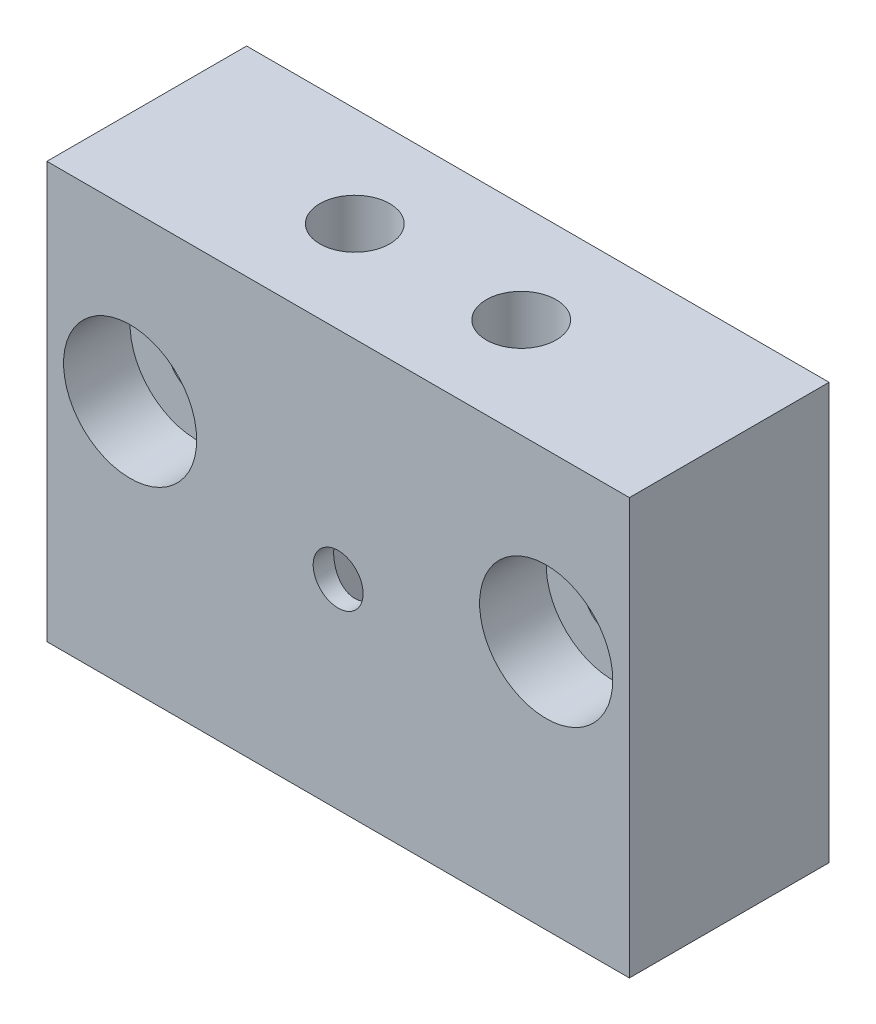
ISO-10303-21;
HEADER;
FILE_DESCRIPTION(('STEP AP214'),'2;1');
FILE_NAME('part.step','',(''),(''),'','','');
FILE_SCHEMA(('AUTOMOTIVE_DESIGN { 1 0 10303 214 1 1 1 1 }'));
ENDSEC;
DATA;
#1=APPLICATION_CONTEXT('core data for automotive mechanical design processes');
#2=APPLICATION_PROTOCOL_DEFINITION('international standard','automotive_design',2000,#1);
#3=PRODUCT_CONTEXT('',#1,'mechanical');
#4=PRODUCT('Part','Part','',(#3));
#5=PRODUCT_RELATED_PRODUCT_CATEGORY('part','',(#4));
#6=PRODUCT_DEFINITION_FORMATION('','',#4);
#7=PRODUCT_DEFINITION_CONTEXT('part definition',#1,'design');
#8=PRODUCT_DEFINITION('design','',#6,#7);
#9=PRODUCT_DEFINITION_SHAPE('','',#8);
#10=(LENGTH_UNIT() NAMED_UNIT(*) SI_UNIT(.MILLI.,.METRE.));
#11=(NAMED_UNIT(*) PLANE_ANGLE_UNIT() SI_UNIT($,.RADIAN.));
#12=(NAMED_UNIT(*) SI_UNIT($,.STERADIAN.) SOLID_ANGLE_UNIT());
#13=UNCERTAINTY_MEASURE_WITH_UNIT(LENGTH_MEASURE(1.E-05),#10,'distance_accuracy_value','');
#14=(GEOMETRIC_REPRESENTATION_CONTEXT(3) GLOBAL_UNCERTAINTY_ASSIGNED_CONTEXT((#13)) GLOBAL_UNIT_ASSIGNED_CONTEXT((#10,
#11,#12)) REPRESENTATION_CONTEXT('',''));
#15=CARTESIAN_POINT('',(0.,0.,0.));
#16=DIRECTION('',(0.,0.,1.));
#17=DIRECTION('',(1.,0.,0.));
#18=AXIS2_PLACEMENT_3D('',#15,#16,#17);
#19=CARTESIAN_POINT('',(12.5,15.,-6.));
#20=DIRECTION('',(0.,0.,1.));
#21=DIRECTION('',(1.,0.,0.));
#22=AXIS2_PLACEMENT_3D('',#19,#20,#21);
#23=CYLINDRICAL_SURFACE('',#22,1.75);
#24=CARTESIAN_POINT('',(12.5,15.,-6.));
#25=DIRECTION('',(0.,0.,1.));
#26=DIRECTION('',(1.,0.,0.));
#27=AXIS2_PLACEMENT_3D('',#24,#25,#26);
#28=CIRCLE('',#27,1.75);
#29=CARTESIAN_POINT('',(14.25,15.,-6.));
#30=VERTEX_POINT('',#29);
#31=EDGE_CURVE('E251',#30,#30,#28,.T.);
#32=ORIENTED_EDGE('',*,*,#31,.F.);
#33=EDGE_LOOP('',(#32));
#34=FACE_BOUND('',#33,.T.);
#35=CARTESIAN_POINT('',(12.5,15.,2.));
#36=DIRECTION('',(0.,0.,1.));
#37=DIRECTION('',(1.,0.,0.));
#38=AXIS2_PLACEMENT_3D('',#35,#36,#37);
#39=CIRCLE('',#38,1.75);
#40=CARTESIAN_POINT('',(14.25,15.,2.));
#41=VERTEX_POINT('',#40);
#42=EDGE_CURVE('E36',#41,#41,#39,.F.);
#43=ORIENTED_EDGE('',*,*,#42,.F.);
#44=EDGE_LOOP('',(#43));
#45=FACE_BOUND('',#44,.T.);
#46=ADVANCED_FACE('F32',(#34,#45),#23,.F.);
#47=CARTESIAN_POINT('',(-12.5,15.,-6.));
#48=DIRECTION('',(0.,0.,1.));
#49=DIRECTION('',(1.,0.,0.));
#50=AXIS2_PLACEMENT_3D('',#47,#48,#49);
#51=CYLINDRICAL_SURFACE('',#50,1.75);
#52=CARTESIAN_POINT('',(-12.5,15.,-6.));
#53=DIRECTION('',(0.,0.,1.));
#54=DIRECTION('',(1.,0.,0.));
#55=AXIS2_PLACEMENT_3D('',#52,#53,#54);
#56=CIRCLE('',#55,1.75);
#57=CARTESIAN_POINT('',(-10.75,15.,-6.));
#58=VERTEX_POINT('',#57);
#59=EDGE_CURVE('E254',#58,#58,#56,.T.);
#60=ORIENTED_EDGE('',*,*,#59,.F.);
#61=EDGE_LOOP('',(#60));
#62=FACE_BOUND('',#61,.T.);
#63=CARTESIAN_POINT('',(-12.5,15.,2.));
#64=DIRECTION('',(0.,0.,1.));
#65=DIRECTION('',(1.,0.,0.));
#66=AXIS2_PLACEMENT_3D('',#63,#64,#65);
#67=CIRCLE('',#66,1.75);
#68=CARTESIAN_POINT('',(-10.75,15.,2.));
#69=VERTEX_POINT('',#68);
#70=EDGE_CURVE('E176',#69,#69,#67,.F.);
#71=ORIENTED_EDGE('',*,*,#70,.F.);
#72=EDGE_LOOP('',(#71));
#73=FACE_BOUND('',#72,.T.);
#74=ADVANCED_FACE('F187',(#62,#73),#51,.F.);
#75=CARTESIAN_POINT('',(-17.5,25.,-6.));
#76=DIRECTION('',(1.,0.,0.));
#77=DIRECTION('',(0.,0.,-1.));
#78=AXIS2_PLACEMENT_3D('',#75,#76,#77);
#79=PLANE('',#78);
#80=DIRECTION('',(0.,0.,1.));
#81=VECTOR('',#80,1.);
#82=CARTESIAN_POINT('',(-17.5,0.,-6.));
#83=LINE('',#82,#81);
#84=CARTESIAN_POINT('',(-17.5,0.,-6.));
#85=VERTEX_POINT('',#84);
#86=CARTESIAN_POINT('',(-17.5,0.,6.));
#87=VERTEX_POINT('',#86);
#88=EDGE_CURVE('E132',#85,#87,#83,.T.);
#89=ORIENTED_EDGE('',*,*,#88,.T.);
#90=DIRECTION('',(0.,-1.,0.));
#91=VECTOR('',#90,1.);
#92=CARTESIAN_POINT('',(-17.5,25.,6.));
#93=LINE('',#92,#91);
#94=CARTESIAN_POINT('',(-17.5,25.,6.));
#95=VERTEX_POINT('',#94);
#96=EDGE_CURVE('E161',#95,#87,#93,.T.);
#97=ORIENTED_EDGE('',*,*,#96,.F.);
#98=DIRECTION('',(0.,0.,1.));
#99=VECTOR('',#98,1.);
#100=CARTESIAN_POINT('',(-17.5,25.,-6.));
#101=LINE('',#100,#99);
#102=CARTESIAN_POINT('',(-17.5,25.,-6.));
#103=VERTEX_POINT('',#102);
#104=EDGE_CURVE('E135',#103,#95,#101,.T.);
#105=ORIENTED_EDGE('',*,*,#104,.F.);
#106=DIRECTION('',(0.,-1.,0.));
#107=VECTOR('',#106,1.);
#108=CARTESIAN_POINT('',(-17.5,25.,-6.));
#109=LINE('',#108,#107);
#110=EDGE_CURVE('E145',#103,#85,#109,.T.);
#111=ORIENTED_EDGE('',*,*,#110,.T.);
#112=EDGE_LOOP('',(#89,#97,#105,#111));
#113=FACE_BOUND('',#112,.T.);
#114=ADVANCED_FACE('F34',(#113),#79,.F.);
#115=CARTESIAN_POINT('',(-17.5,25.,6.));
#116=DIRECTION('',(0.,0.,-1.));
#117=DIRECTION('',(-1.,0.,0.));
#118=AXIS2_PLACEMENT_3D('',#115,#116,#117);
#119=PLANE('',#118);
#120=CARTESIAN_POINT('',(12.5,15.,6.));
#121=DIRECTION('',(0.,0.,1.));
#122=DIRECTION('',(1.,0.,0.));
#123=AXIS2_PLACEMENT_3D('',#120,#121,#122);
#124=CIRCLE('',#123,4.);
#125=CARTESIAN_POINT('',(16.5,15.,6.));
#126=VERTEX_POINT('',#125);
#127=EDGE_CURVE('E244',#126,#126,#124,.T.);
#128=ORIENTED_EDGE('',*,*,#127,.F.);
#129=EDGE_LOOP('',(#128));
#130=FACE_BOUND('',#129,.T.);
#131=CARTESIAN_POINT('',(-12.5,15.,6.));
#132=DIRECTION('',(0.,0.,1.));
#133=DIRECTION('',(1.,0.,0.));
#134=AXIS2_PLACEMENT_3D('',#131,#132,#133);
#135=CIRCLE('',#134,4.);
#136=CARTESIAN_POINT('',(-8.5,15.,6.));
#137=VERTEX_POINT('',#136);
#138=EDGE_CURVE('E240',#137,#137,#135,.T.);
#139=ORIENTED_EDGE('',*,*,#138,.F.);
#140=EDGE_LOOP('',(#139));
#141=FACE_BOUND('',#140,.T.);
#142=CARTESIAN_POINT('',(0.,12.,6.));
#143=DIRECTION('',(0.,0.,1.));
#144=DIRECTION('',(1.,0.,0.));
#145=AXIS2_PLACEMENT_3D('',#142,#143,#144);
#146=CIRCLE('',#145,1.5);
#147=CARTESIAN_POINT('',(1.5,12.,6.));
#148=VERTEX_POINT('',#147);
#149=EDGE_CURVE('E175',#148,#148,#146,.T.);
#150=ORIENTED_EDGE('',*,*,#149,.F.);
#151=EDGE_LOOP('',(#150));
#152=FACE_BOUND('',#151,.T.);
#153=DIRECTION('',(1.,0.,0.));
#154=VECTOR('',#153,1.);
#155=CARTESIAN_POINT('',(-17.5,0.,6.));
#156=LINE('',#155,#154);
#157=CARTESIAN_POINT('',(17.5,0.,6.));
#158=VERTEX_POINT('',#157);
#159=EDGE_CURVE('E148',#87,#158,#156,.T.);
#160=ORIENTED_EDGE('',*,*,#159,.T.);
#161=DIRECTION('',(0.,-1.,0.));
#162=VECTOR('',#161,1.);
#163=CARTESIAN_POINT('',(17.5,25.,6.));
#164=LINE('',#163,#162);
#165=CARTESIAN_POINT('',(17.5,25.,6.));
#166=VERTEX_POINT('',#165);
#167=EDGE_CURVE('E158',#166,#158,#164,.T.);
#168=ORIENTED_EDGE('',*,*,#167,.F.);
#169=DIRECTION('',(1.,0.,0.));
#170=VECTOR('',#169,1.);
#171=CARTESIAN_POINT('',(-17.5,25.,6.));
#172=LINE('',#171,#170);
#173=EDGE_CURVE('E138',#95,#166,#172,.T.);
#174=ORIENTED_EDGE('',*,*,#173,.F.);
#175=ORIENTED_EDGE('',*,*,#96,.T.);
#176=EDGE_LOOP('',(#160,#168,#174,#175));
#177=FACE_BOUND('',#176,.T.);
#178=ADVANCED_FACE('F275',(#130,#141,#152,#177),#119,.F.);
#179=CARTESIAN_POINT('',(17.5,25.,-6.));
#180=DIRECTION('',(-1.,0.,0.));
#181=DIRECTION('',(0.,0.,1.));
#182=AXIS2_PLACEMENT_3D('',#179,#180,#181);
#183=PLANE('',#182);
#184=DIRECTION('',(0.,0.,-1.));
#185=VECTOR('',#184,1.);
#186=CARTESIAN_POINT('',(17.5,0.,-6.));
#187=LINE('',#186,#185);
#188=CARTESIAN_POINT('',(17.5,0.,-6.));
#189=VERTEX_POINT('',#188);
#190=EDGE_CURVE('E150',#158,#189,#187,.T.);
#191=ORIENTED_EDGE('',*,*,#190,.T.);
#192=DIRECTION('',(0.,-1.,0.));
#193=VECTOR('',#192,1.);
#194=CARTESIAN_POINT('',(17.5,25.,-6.));
#195=LINE('',#194,#193);
#196=CARTESIAN_POINT('',(17.5,25.,-6.));
#197=VERTEX_POINT('',#196);
#198=EDGE_CURVE('E155',#197,#189,#195,.T.);
#199=ORIENTED_EDGE('',*,*,#198,.F.);
#200=DIRECTION('',(0.,0.,-1.));
#201=VECTOR('',#200,1.);
#202=CARTESIAN_POINT('',(17.5,25.,-6.));
#203=LINE('',#202,#201);
#204=EDGE_CURVE('E141',#166,#197,#203,.T.);
#205=ORIENTED_EDGE('',*,*,#204,.F.);
#206=ORIENTED_EDGE('',*,*,#167,.T.);
#207=EDGE_LOOP('',(#191,#199,#205,#206));
#208=FACE_BOUND('',#207,.T.);
#209=ADVANCED_FACE('F280',(#208),#183,.F.);
#210=CARTESIAN_POINT('',(-17.5,25.,-6.));
#211=DIRECTION('',(0.,0.,1.));
#212=DIRECTION('',(1.,0.,0.));
#213=AXIS2_PLACEMENT_3D('',#210,#211,#212);
#214=PLANE('',#213);
#215=ORIENTED_EDGE('',*,*,#31,.T.);
#216=EDGE_LOOP('',(#215));
#217=FACE_BOUND('',#216,.T.);
#218=ORIENTED_EDGE('',*,*,#59,.T.);
#219=EDGE_LOOP('',(#218));
#220=FACE_BOUND('',#219,.T.);
#221=DIRECTION('',(-1.,0.,0.));
#222=VECTOR('',#221,1.);
#223=CARTESIAN_POINT('',(-17.5,0.,-6.));
#224=LINE('',#223,#222);
#225=EDGE_CURVE('E139',#189,#85,#224,.T.);
#226=ORIENTED_EDGE('',*,*,#225,.T.);
#227=ORIENTED_EDGE('',*,*,#110,.F.);
#228=DIRECTION('',(-1.,0.,0.));
#229=VECTOR('',#228,1.);
#230=CARTESIAN_POINT('',(-17.5,25.,-6.));
#231=LINE('',#230,#229);
#232=EDGE_CURVE('E143',#197,#103,#231,.T.);
#233=ORIENTED_EDGE('',*,*,#232,.F.);
#234=ORIENTED_EDGE('',*,*,#198,.T.);
#235=EDGE_LOOP('',(#226,#227,#233,#234));
#236=FACE_BOUND('',#235,.T.);
#237=ADVANCED_FACE('F264',(#217,#220,#236),#214,.F.);
#238=CARTESIAN_POINT('',(0.,25.,0.));
#239=DIRECTION('',(0.,1.,0.));
#240=DIRECTION('',(0.,0.,1.));
#241=AXIS2_PLACEMENT_3D('',#238,#239,#240);
#242=PLANE('',#241);
#243=CARTESIAN_POINT('',(5.,25.,0.));
#244=DIRECTION('',(0.,1.,0.));
#245=DIRECTION('',(0.,0.,1.));
#246=AXIS2_PLACEMENT_3D('',#243,#244,#245);
#247=CIRCLE('',#246,2.1);
#248=CARTESIAN_POINT('',(5.,25.,2.1));
#249=VERTEX_POINT('',#248);
#250=EDGE_CURVE('E110',#249,#249,#247,.T.);
#251=ORIENTED_EDGE('',*,*,#250,.F.);
#252=EDGE_LOOP('',(#251));
#253=FACE_BOUND('',#252,.T.);
#254=CARTESIAN_POINT('',(-5.,25.,0.));
#255=DIRECTION('',(0.,1.,0.));
#256=DIRECTION('',(0.,0.,1.));
#257=AXIS2_PLACEMENT_3D('',#254,#255,#256);
#258=CIRCLE('',#257,2.1);
#259=CARTESIAN_POINT('',(-5.,25.,2.1));
#260=VERTEX_POINT('',#259);
#261=EDGE_CURVE('E117',#260,#260,#258,.T.);
#262=ORIENTED_EDGE('',*,*,#261,.F.);
#263=EDGE_LOOP('',(#262));
#264=FACE_BOUND('',#263,.T.);
#265=ORIENTED_EDGE('',*,*,#104,.T.);
#266=ORIENTED_EDGE('',*,*,#173,.T.);
#267=ORIENTED_EDGE('',*,*,#204,.T.);
#268=ORIENTED_EDGE('',*,*,#232,.T.);
#269=EDGE_LOOP('',(#265,#266,#267,#268));
#270=FACE_BOUND('',#269,.T.);
#271=ADVANCED_FACE('F261',(#253,#264,#270),#242,.T.);
#272=CARTESIAN_POINT('',(0.,0.,0.));
#273=DIRECTION('',(0.,1.,0.));
#274=DIRECTION('',(0.,0.,1.));
#275=AXIS2_PLACEMENT_3D('',#272,#273,#274);
#276=PLANE('',#275);
#277=CARTESIAN_POINT('',(0.,0.,0.));
#278=DIRECTION('',(0.,-1.,0.));
#279=DIRECTION('',(0.,0.,-1.));
#280=AXIS2_PLACEMENT_3D('',#277,#278,#279);
#281=CIRCLE('',#280,5.);
#282=CARTESIAN_POINT('',(0.,0.,-5.));
#283=VERTEX_POINT('',#282);
#284=EDGE_CURVE('E129',#283,#283,#281,.T.);
#285=ORIENTED_EDGE('',*,*,#284,.F.);
#286=EDGE_LOOP('',(#285));
#287=FACE_BOUND('',#286,.T.);
#288=ORIENTED_EDGE('',*,*,#88,.F.);
#289=ORIENTED_EDGE('',*,*,#225,.F.);
#290=ORIENTED_EDGE('',*,*,#190,.F.);
#291=ORIENTED_EDGE('',*,*,#159,.F.);
#292=EDGE_LOOP('',(#288,#289,#290,#291));
#293=FACE_BOUND('',#292,.T.);
#294=ADVANCED_FACE('F207',(#287,#293),#276,.F.);
#295=CARTESIAN_POINT('',(0.,18.,0.));
#296=DIRECTION('',(0.,-1.,0.));
#297=DIRECTION('',(0.,0.,-1.));
#298=AXIS2_PLACEMENT_3D('',#295,#296,#297);
#299=CYLINDRICAL_SURFACE('',#298,5.);
#300=CARTESIAN_POINT('',(1.5,12.,4.76969600708473));
#301=CARTESIAN_POINT('',(1.49999897633764,12.0821945479424,4.7696968572698));
#302=CARTESIAN_POINT('',(1.49322108167142,12.164399224144,4.77184390209069));
#303=CARTESIAN_POINT('',(1.46635844446749,12.3264052495919,4.780165783029));
#304=CARTESIAN_POINT('',(1.44626925573578,12.4062057865015,4.78634196493468));
#305=CARTESIAN_POINT('',(1.39352753269955,12.5610347282717,4.80196102485633));
#306=CARTESIAN_POINT('',(1.36089589394243,12.6360708296331,4.81139846703232));
#307=CARTESIAN_POINT('',(1.28406421917929,12.7796219339953,4.83246932547567));
#308=CARTESIAN_POINT('',(1.23986245137053,12.8481359586844,4.84410307041019));
#309=CARTESIAN_POINT('',(1.13964754141627,12.9788663905774,4.86866862185765));
#310=CARTESIAN_POINT('',(1.08333207175807,13.0408458979463,4.88162808311636));
#311=CARTESIAN_POINT('',(0.961136237579599,13.1546379513225,4.90714861936757));
#312=CARTESIAN_POINT('',(0.895254645461112,13.2064491904499,4.91970964297705));
#313=CARTESIAN_POINT('',(0.754111437793691,13.2994626998333,4.94333214579389));
#314=CARTESIAN_POINT('',(0.678684021335816,13.3404234244428,4.95435724342404));
#315=CARTESIAN_POINT('',(0.521624645369355,13.4089872590428,4.97334435920684));
#316=CARTESIAN_POINT('',(0.439994028387912,13.4365932498574,4.98130703789495));
#317=CARTESIAN_POINT('',(0.27532385263083,13.4768800010905,4.99307646003589));
#318=CARTESIAN_POINT('',(0.192391398953801,13.4899651276527,4.99699557369338));
#319=CARTESIAN_POINT('',(0.0254218237493156,13.5021173246464,5.00063201501348));
#320=CARTESIAN_POINT('',(-0.0586150620503676,13.501187339402,5.00035022521079));
#321=CARTESIAN_POINT('',(-0.222571156600159,13.485607131457,4.99569603817659));
#322=CARTESIAN_POINT('',(-0.302536267641341,13.4713948061901,4.9914542020526));
#323=CARTESIAN_POINT('',(-0.458889213442526,13.4303686640057,4.97951522112593));
#324=CARTESIAN_POINT('',(-0.535276821322845,13.4035540490573,4.97181785750586));
#325=CARTESIAN_POINT('',(-0.68334732635128,13.3377879765814,4.95365220986963));
#326=CARTESIAN_POINT('',(-0.754965064694477,13.2986987971927,4.94315269676706));
#327=CARTESIAN_POINT('',(-0.890764673783155,13.2096021475718,4.92049640648069));
#328=CARTESIAN_POINT('',(-0.95494477487213,13.1595920870365,4.90833923637778));
#329=CARTESIAN_POINT('',(-1.0766604815298,13.0478022492484,4.88311550488165));
#330=CARTESIAN_POINT('',(-1.13384458040111,12.9856430809703,4.87003195321461));
#331=CARTESIAN_POINT('',(-1.23707651539823,12.8524899821099,4.84483979887497));
#332=CARTESIAN_POINT('',(-1.28312324482852,12.7814951746108,4.8327312931702));
#333=CARTESIAN_POINT('',(-1.3631399533545,12.631760530751,4.81077903197678));
#334=CARTESIAN_POINT('',(-1.39698989237679,12.5529529541371,4.80095810695957));
#335=CARTESIAN_POINT('',(-1.45083362878413,12.3903927915545,4.78496392548436));
#336=CARTESIAN_POINT('',(-1.4708319464056,12.3066418284654,4.7787894791583));
#337=CARTESIAN_POINT('',(-1.49574770282165,12.1399176392607,4.77104849541241));
#338=CARTESIAN_POINT('',(-1.50119946380212,12.057031776106,4.7693187867044));
#339=CARTESIAN_POINT('',(-1.49835947233062,11.8915270999901,4.77021192441924));
#340=CARTESIAN_POINT('',(-1.4900696437133,11.8089082512692,4.77283416156589));
#341=CARTESIAN_POINT('',(-1.4604576357419,11.6485116220291,4.78197558554912));
#342=CARTESIAN_POINT('',(-1.4394796143128,11.5706638357365,4.78839176507489));
#343=CARTESIAN_POINT('',(-1.3854857774794,11.4195983091851,4.80429141231227));
#344=CARTESIAN_POINT('',(-1.3524681034276,11.3463812858594,4.81377535359073));
#345=CARTESIAN_POINT('',(-1.27431871196501,11.2044825359279,4.83505835023047));
#346=CARTESIAN_POINT('',(-1.22888564172729,11.1359752790142,4.84691271069798));
#347=CARTESIAN_POINT('',(-1.12755301600385,11.0073618938192,4.87148205646987));
#348=CARTESIAN_POINT('',(-1.07165095534897,10.9472577823872,4.88419724730003));
#349=CARTESIAN_POINT('',(-0.9484551324936,10.8348195941853,4.90963633548158));
#350=CARTESIAN_POINT('',(-0.880811065857435,10.782864371013,4.92234245063004));
#351=CARTESIAN_POINT('',(-0.737461784590251,10.6910332989722,4.94584851748651));
#352=CARTESIAN_POINT('',(-0.661756970543946,10.6511568502185,4.95664856384717));
#353=CARTESIAN_POINT('',(-0.504935504705224,10.5849999694317,4.97505970474957));
#354=CARTESIAN_POINT('',(-0.423864622037841,10.558617983841,4.98269453424965));
#355=CARTESIAN_POINT('',(-0.25816996650459,10.5199390811096,4.99401979596827));
#356=CARTESIAN_POINT('',(-0.173547217354765,10.5076381340516,4.9977113567088));
#357=CARTESIAN_POINT('',(-0.00665215388274505,10.4977769559455,5.00066544081399));
#358=CARTESIAN_POINT('',(0.0755851790862044,10.4996673045922,5.00009305111322));
#359=CARTESIAN_POINT('',(0.238519481164402,10.5168216324991,4.99497264465037));
#360=CARTESIAN_POINT('',(0.319216537346526,10.5320848534804,4.99042485330463));
#361=CARTESIAN_POINT('',(0.475935813041356,10.5752116613996,4.97791168358327));
#362=CARTESIAN_POINT('',(0.55199892735139,10.602938180649,4.96998352900866));
#363=CARTESIAN_POINT('',(0.698433237752051,10.6700819145072,4.9515294303945));
#364=CARTESIAN_POINT('',(0.768803496050578,10.7095010502862,4.94100305949946));
#365=CARTESIAN_POINT('',(0.904301892420561,10.80037345743,4.91803965828228));
#366=CARTESIAN_POINT('',(0.969190250076765,10.8521714300008,4.90555226923559));
#367=CARTESIAN_POINT('',(1.08953757134594,10.9657103883328,4.88023537212334));
#368=CARTESIAN_POINT('',(1.14499380960193,11.0274542378981,4.86740576641079));
#369=CARTESIAN_POINT('',(1.24656269394549,11.1613407783105,4.84240680631319));
#370=CARTESIAN_POINT('',(1.29234759757956,11.2337385533904,4.83026852693485));
#371=CARTESIAN_POINT('',(1.37104313528776,11.385555174161,4.80852547508793));
#372=CARTESIAN_POINT('',(1.40395995557288,11.4649706236012,4.79891948596955));
#373=CARTESIAN_POINT('',(1.45301942532949,11.6197404316063,4.78427816717595));
#374=CARTESIAN_POINT('',(1.47058859011232,11.694608646931,4.7788615484052));
#375=CARTESIAN_POINT('',(1.49407818835144,11.8463152224958,4.77157042597167));
#376=CARTESIAN_POINT('',(1.50000095706095,11.9231531846452,4.7696952122143));
#377=CARTESIAN_POINT('',(1.5,12.,4.76969600708473));
#378=B_SPLINE_CURVE_WITH_KNOTS('',3,(#300,#301,#302,#303,#304,#305,#306,#307,#308,#309,#310,
#311,#312,#313,#314,#315,#316,#317,#318,#319,#320,#321,#322,#323,#324,#325,#326,#327,#328,#329,
#330,#331,#332,#333,#334,#335,#336,#337,#338,#339,#340,#341,#342,#343,#344,#345,#346,#347,#348,
#349,#350,#351,#352,#353,#354,#355,#356,#357,#358,#359,#360,#361,#362,#363,#364,#365,#366,#367,
#368,#369,#370,#371,#372,#373,#374,#375,#376,#377),.UNSPECIFIED.,.T.,.F.,(4,2,2,2,2,2,2,2,2,2,2,
2,2,2,2,2,2,2,2,2,2,2,2,2,2,2,2,2,2,2,2,2,2,2,2,2,2,2,4),(0.,0.246300165915542,
0.492682641688999,0.738656414466193,0.9846670253701,1.23773150007984,1.49082847871273,
1.74915939273644,2.00743455587877,2.25832140149558,2.5091555410144,2.7520012599088,
2.99486235890376,3.24055209335676,3.4863001659083,3.74152147023278,3.99676812491863,
4.25446238246266,4.51207250628411,4.76008080790309,5.00805439107387,5.24958594938817,
5.49115481045787,5.73920731809388,5.98731925928923,6.24479506100602,6.50225807324202,
6.75775391814325,7.01317662321682,7.2587630391122,7.50433553047754,7.74727096872219,
7.99024634491378,8.24099627054488,8.4918185262989,8.75011639669147,9.00828993963944,
9.23861153857448,9.4688869503356),.UNSPECIFIED.);
#379=CARTESIAN_POINT('',(1.5,12.,4.76969600708473));
#380=VERTEX_POINT('',#379);
#381=EDGE_CURVE('E169',#380,#380,#378,.T.);
#382=ORIENTED_EDGE('',*,*,#381,.T.);
#383=EDGE_LOOP('',(#382));
#384=FACE_BOUND('',#383,.T.);
#385=CARTESIAN_POINT('',(0.,18.,0.));
#386=DIRECTION('',(0.,-1.,0.));
#387=DIRECTION('',(0.,0.,-1.));
#388=AXIS2_PLACEMENT_3D('',#385,#386,#387);
#389=CIRCLE('',#388,5.);
#390=CARTESIAN_POINT('',(4.559,18.,2.0531729103999));
#391=VERTEX_POINT('',#390);
#392=CARTESIAN_POINT('',(-4.559,18.,2.0531729103999));
#393=VERTEX_POINT('',#392);
#394=EDGE_CURVE('E116',#391,#393,#389,.T.);
#395=ORIENTED_EDGE('',*,*,#394,.F.);
#396=DIRECTION('',(0.,1.,0.));
#397=VECTOR('',#396,1.);
#398=CARTESIAN_POINT('',(4.559,17.5,2.0531729103999));
#399=LINE('',#398,#397);
#400=CARTESIAN_POINT('',(4.559,10.,2.0531729103999));
#401=VERTEX_POINT('',#400);
#402=EDGE_CURVE('E49',#391,#401,#399,.F.);
#403=ORIENTED_EDGE('',*,*,#402,.T.);
#404=CARTESIAN_POINT('',(0.,10.,0.));
#405=DIRECTION('',(0.,1.,0.));
#406=DIRECTION('',(0.,0.,1.));
#407=AXIS2_PLACEMENT_3D('',#404,#405,#406);
#408=CIRCLE('',#407,5.);
#409=CARTESIAN_POINT('',(4.559,10.,-2.0531729103999));
#410=VERTEX_POINT('',#409);
#411=EDGE_CURVE('E11',#410,#401,#408,.F.);
#412=ORIENTED_EDGE('',*,*,#411,.F.);
#413=DIRECTION('',(0.,1.,0.));
#414=VECTOR('',#413,1.);
#415=CARTESIAN_POINT('',(4.559,17.5,-2.0531729103999));
#416=LINE('',#415,#414);
#417=CARTESIAN_POINT('',(4.559,18.,-2.0531729103999));
#418=VERTEX_POINT('',#417);
#419=EDGE_CURVE('E99',#410,#418,#416,.T.);
#420=ORIENTED_EDGE('',*,*,#419,.T.);
#421=CARTESIAN_POINT('',(-4.559,18.,-2.0531729103999));
#422=VERTEX_POINT('',#421);
#423=EDGE_CURVE('E130',#422,#418,#389,.T.);
#424=ORIENTED_EDGE('',*,*,#423,.F.);
#425=DIRECTION('',(0.,1.,0.));
#426=VECTOR('',#425,1.);
#427=CARTESIAN_POINT('',(-4.559,17.5,-2.0531729103999));
#428=LINE('',#427,#426);
#429=CARTESIAN_POINT('',(-4.559,10.,-2.0531729103999));
#430=VERTEX_POINT('',#429);
#431=EDGE_CURVE('E57',#422,#430,#428,.F.);
#432=ORIENTED_EDGE('',*,*,#431,.T.);
#433=CARTESIAN_POINT('',(0.,10.,0.));
#434=DIRECTION('',(0.,1.,0.));
#435=DIRECTION('',(0.,0.,1.));
#436=AXIS2_PLACEMENT_3D('',#433,#434,#435);
#437=CIRCLE('',#436,5.);
#438=CARTESIAN_POINT('',(-4.559,10.,2.0531729103999));
#439=VERTEX_POINT('',#438);
#440=EDGE_CURVE('E166',#439,#430,#437,.F.);
#441=ORIENTED_EDGE('',*,*,#440,.F.);
#442=DIRECTION('',(0.,1.,0.));
#443=VECTOR('',#442,1.);
#444=CARTESIAN_POINT('',(-4.559,17.5,2.0531729103999));
#445=LINE('',#444,#443);
#446=EDGE_CURVE('E125',#439,#393,#445,.T.);
#447=ORIENTED_EDGE('',*,*,#446,.T.);
#448=EDGE_LOOP('',(#395,#403,#412,#420,#424,#432,#441,#447));
#449=FACE_BOUND('',#448,.T.);
#450=ORIENTED_EDGE('',*,*,#284,.T.);
#451=EDGE_LOOP('',(#450));
#452=FACE_BOUND('',#451,.T.);
#453=ADVANCED_FACE('F113',(#384,#449,#452),#299,.F.);
#454=CARTESIAN_POINT('',(0.,18.,0.));
#455=DIRECTION('',(0.,-1.,0.));
#456=DIRECTION('',(0.,0.,-1.));
#457=AXIS2_PLACEMENT_3D('',#454,#455,#456);
#458=PLANE('',#457);
#459=CARTESIAN_POINT('',(5.,18.,0.));
#460=DIRECTION('',(0.,-1.,0.));
#461=DIRECTION('',(0.,0.,-1.));
#462=AXIS2_PLACEMENT_3D('',#459,#460,#461);
#463=CIRCLE('',#462,2.1);
#464=EDGE_CURVE('E41',#391,#418,#463,.T.);
#465=ORIENTED_EDGE('',*,*,#464,.F.);
#466=ORIENTED_EDGE('',*,*,#394,.T.);
#467=CARTESIAN_POINT('',(-5.,18.,0.));
#468=DIRECTION('',(0.,-1.,0.));
#469=DIRECTION('',(0.,0.,-1.));
#470=AXIS2_PLACEMENT_3D('',#467,#468,#469);
#471=CIRCLE('',#470,2.1);
#472=EDGE_CURVE('E164',#422,#393,#471,.T.);
#473=ORIENTED_EDGE('',*,*,#472,.F.);
#474=ORIENTED_EDGE('',*,*,#423,.T.);
#475=EDGE_LOOP('',(#465,#466,#473,#474));
#476=FACE_BOUND('',#475,.T.);
#477=ADVANCED_FACE('F198',(#476),#458,.T.);
#478=CARTESIAN_POINT('',(-5.,10.,0.));
#479=DIRECTION('',(0.,1.,0.));
#480=DIRECTION('',(0.,0.,1.));
#481=AXIS2_PLACEMENT_3D('',#478,#479,#480);
#482=PLANE('',#481);
#483=ORIENTED_EDGE('',*,*,#440,.T.);
#484=CARTESIAN_POINT('',(-5.,10.,0.));
#485=DIRECTION('',(0.,1.,0.));
#486=DIRECTION('',(0.,0.,1.));
#487=AXIS2_PLACEMENT_3D('',#484,#485,#486);
#488=CIRCLE('',#487,2.1);
#489=EDGE_CURVE('E120',#430,#439,#488,.T.);
#490=ORIENTED_EDGE('',*,*,#489,.T.);
#491=EDGE_LOOP('',(#483,#490));
#492=FACE_BOUND('',#491,.T.);
#493=ADVANCED_FACE('F195',(#492),#482,.T.);
#494=CARTESIAN_POINT('',(-5.,10.,0.));
#495=DIRECTION('',(0.,1.,0.));
#496=DIRECTION('',(0.,0.,1.));
#497=AXIS2_PLACEMENT_3D('',#494,#495,#496);
#498=CYLINDRICAL_SURFACE('',#497,2.1);
#499=ORIENTED_EDGE('',*,*,#261,.T.);
#500=EDGE_LOOP('',(#499));
#501=FACE_BOUND('',#500,.T.);
#502=ORIENTED_EDGE('',*,*,#472,.T.);
#503=ORIENTED_EDGE('',*,*,#446,.F.);
#504=ORIENTED_EDGE('',*,*,#489,.F.);
#505=ORIENTED_EDGE('',*,*,#431,.F.);
#506=EDGE_LOOP('',(#502,#503,#504,#505));
#507=FACE_BOUND('',#506,.T.);
#508=ADVANCED_FACE('F191',(#501,#507),#498,.F.);
#509=CARTESIAN_POINT('',(5.,10.,0.));
#510=DIRECTION('',(0.,1.,0.));
#511=DIRECTION('',(0.,0.,1.));
#512=AXIS2_PLACEMENT_3D('',#509,#510,#511);
#513=PLANE('',#512);
#514=ORIENTED_EDGE('',*,*,#411,.T.);
#515=CARTESIAN_POINT('',(5.,10.,0.));
#516=DIRECTION('',(0.,1.,0.));
#517=DIRECTION('',(0.,0.,1.));
#518=AXIS2_PLACEMENT_3D('',#515,#516,#517);
#519=CIRCLE('',#518,2.1);
#520=EDGE_CURVE('E102',#401,#410,#519,.T.);
#521=ORIENTED_EDGE('',*,*,#520,.T.);
#522=EDGE_LOOP('',(#514,#521));
#523=FACE_BOUND('',#522,.T.);
#524=ADVANCED_FACE('F109',(#523),#513,.T.);
#525=CARTESIAN_POINT('',(5.,10.,0.));
#526=DIRECTION('',(0.,1.,0.));
#527=DIRECTION('',(0.,0.,1.));
#528=AXIS2_PLACEMENT_3D('',#525,#526,#527);
#529=CYLINDRICAL_SURFACE('',#528,2.1);
#530=ORIENTED_EDGE('',*,*,#250,.T.);
#531=EDGE_LOOP('',(#530));
#532=FACE_BOUND('',#531,.T.);
#533=ORIENTED_EDGE('',*,*,#464,.T.);
#534=ORIENTED_EDGE('',*,*,#419,.F.);
#535=ORIENTED_EDGE('',*,*,#520,.F.);
#536=ORIENTED_EDGE('',*,*,#402,.F.);
#537=EDGE_LOOP('',(#533,#534,#535,#536));
#538=FACE_BOUND('',#537,.T.);
#539=ADVANCED_FACE('F101',(#532,#538),#529,.F.);
#540=CARTESIAN_POINT('',(0.,12.,-1.));
#541=DIRECTION('',(0.,0.,1.));
#542=DIRECTION('',(1.,0.,0.));
#543=AXIS2_PLACEMENT_3D('',#540,#541,#542);
#544=CYLINDRICAL_SURFACE('',#543,1.5);
#545=ORIENTED_EDGE('',*,*,#149,.T.);
#546=EDGE_LOOP('',(#545));
#547=FACE_BOUND('',#546,.T.);
#548=ORIENTED_EDGE('',*,*,#381,.F.);
#549=EDGE_LOOP('',(#548));
#550=FACE_BOUND('',#549,.T.);
#551=ADVANCED_FACE('F180',(#547,#550),#544,.F.);
#552=CARTESIAN_POINT('',(-12.5,15.,2.));
#553=DIRECTION('',(0.,0.,1.));
#554=DIRECTION('',(1.,0.,0.));
#555=AXIS2_PLACEMENT_3D('',#552,#553,#554);
#556=PLANE('',#555);
#557=CARTESIAN_POINT('',(-12.5,15.,2.));
#558=DIRECTION('',(0.,0.,1.));
#559=DIRECTION('',(1.,0.,0.));
#560=AXIS2_PLACEMENT_3D('',#557,#558,#559);
#561=CIRCLE('',#560,4.);
#562=CARTESIAN_POINT('',(-8.5,15.,2.));
#563=VERTEX_POINT('',#562);
#564=EDGE_CURVE('E242',#563,#563,#561,.T.);
#565=ORIENTED_EDGE('',*,*,#564,.T.);
#566=EDGE_LOOP('',(#565));
#567=FACE_BOUND('',#566,.T.);
#568=ORIENTED_EDGE('',*,*,#70,.T.);
#569=EDGE_LOOP('',(#568));
#570=FACE_BOUND('',#569,.T.);
#571=ADVANCED_FACE('F185',(#567,#570),#556,.T.);
#572=CARTESIAN_POINT('',(-12.5,15.,2.));
#573=DIRECTION('',(0.,0.,1.));
#574=DIRECTION('',(1.,0.,0.));
#575=AXIS2_PLACEMENT_3D('',#572,#573,#574);
#576=CYLINDRICAL_SURFACE('',#575,4.);
#577=ORIENTED_EDGE('',*,*,#564,.F.);
#578=EDGE_LOOP('',(#577));
#579=FACE_BOUND('',#578,.T.);
#580=ORIENTED_EDGE('',*,*,#138,.T.);
#581=EDGE_LOOP('',(#580));
#582=FACE_BOUND('',#581,.T.);
#583=ADVANCED_FACE('F218',(#579,#582),#576,.F.);
#584=CARTESIAN_POINT('',(12.5,15.,2.));
#585=DIRECTION('',(0.,0.,1.));
#586=DIRECTION('',(1.,0.,0.));
#587=AXIS2_PLACEMENT_3D('',#584,#585,#586);
#588=PLANE('',#587);
#589=CARTESIAN_POINT('',(12.5,15.,2.));
#590=DIRECTION('',(0.,0.,1.));
#591=DIRECTION('',(1.,0.,0.));
#592=AXIS2_PLACEMENT_3D('',#589,#590,#591);
#593=CIRCLE('',#592,4.);
#594=CARTESIAN_POINT('',(16.5,15.,2.));
#595=VERTEX_POINT('',#594);
#596=EDGE_CURVE('E237',#595,#595,#593,.T.);
#597=ORIENTED_EDGE('',*,*,#596,.T.);
#598=EDGE_LOOP('',(#597));
#599=FACE_BOUND('',#598,.T.);
#600=ORIENTED_EDGE('',*,*,#42,.T.);
#601=EDGE_LOOP('',(#600));
#602=FACE_BOUND('',#601,.T.);
#603=ADVANCED_FACE('F221',(#599,#602),#588,.T.);
#604=CARTESIAN_POINT('',(12.5,15.,2.));
#605=DIRECTION('',(0.,0.,1.));
#606=DIRECTION('',(1.,0.,0.));
#607=AXIS2_PLACEMENT_3D('',#604,#605,#606);
#608=CYLINDRICAL_SURFACE('',#607,4.);
#609=ORIENTED_EDGE('',*,*,#596,.F.);
#610=EDGE_LOOP('',(#609));
#611=FACE_BOUND('',#610,.T.);
#612=ORIENTED_EDGE('',*,*,#127,.T.);
#613=EDGE_LOOP('',(#612));
#614=FACE_BOUND('',#613,.T.);
#615=ADVANCED_FACE('F226',(#611,#614),#608,.F.);
#616=CLOSED_SHELL('',(#46,#74,#114,#178,#209,#237,#271,#294,#453,#477,#493,#508,#524,#539,#551,
#571,#583,#603,#615));
#617=MANIFOLD_SOLID_BREP('B2',#616);
#618=ADVANCED_BREP_SHAPE_REPRESENTATION('',(#18,#617),#14);
#619=SHAPE_DEFINITION_REPRESENTATION(#9,#618);
ENDSEC;
END-ISO-10303-21;
